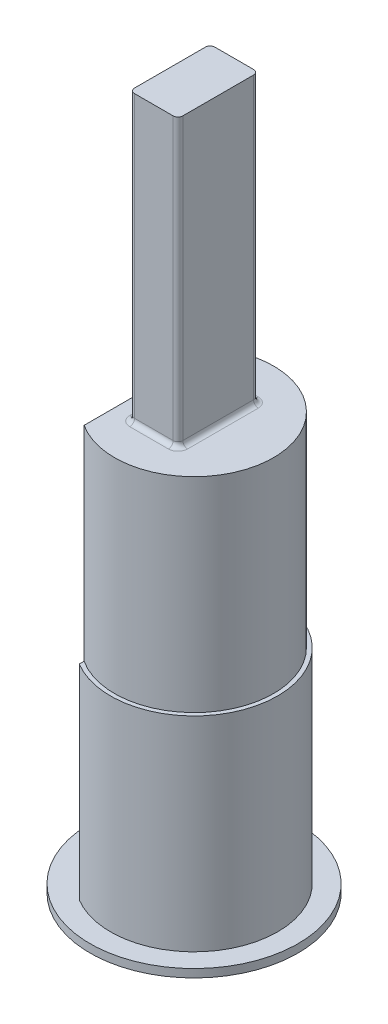
ISO-10303-21;
HEADER;
FILE_DESCRIPTION(('STEP AP214'),'2;1');
FILE_NAME('part.step','',(''),(''),'','','');
FILE_SCHEMA(('AUTOMOTIVE_DESIGN { 1 0 10303 214 1 1 1 1 }'));
ENDSEC;
DATA;
#1=APPLICATION_CONTEXT('core data for automotive mechanical design processes');
#2=APPLICATION_PROTOCOL_DEFINITION('international standard','automotive_design',2000,#1);
#3=PRODUCT_CONTEXT('',#1,'mechanical');
#4=PRODUCT('Part','Part','',(#3));
#5=PRODUCT_RELATED_PRODUCT_CATEGORY('part','',(#4));
#6=PRODUCT_DEFINITION_FORMATION('','',#4);
#7=PRODUCT_DEFINITION_CONTEXT('part definition',#1,'design');
#8=PRODUCT_DEFINITION('design','',#6,#7);
#9=PRODUCT_DEFINITION_SHAPE('','',#8);
#10=(LENGTH_UNIT() NAMED_UNIT(*) SI_UNIT(.MILLI.,.METRE.));
#11=(NAMED_UNIT(*) PLANE_ANGLE_UNIT() SI_UNIT($,.RADIAN.));
#12=(NAMED_UNIT(*) SI_UNIT($,.STERADIAN.) SOLID_ANGLE_UNIT());
#13=UNCERTAINTY_MEASURE_WITH_UNIT(LENGTH_MEASURE(1.E-05),#10,'distance_accuracy_value','');
#14=(GEOMETRIC_REPRESENTATION_CONTEXT(3) GLOBAL_UNCERTAINTY_ASSIGNED_CONTEXT((#13)) GLOBAL_UNIT_ASSIGNED_CONTEXT((#10,
#11,#12)) REPRESENTATION_CONTEXT('',''));
#15=CARTESIAN_POINT('',(0.,0.,0.));
#16=DIRECTION('',(0.,0.,1.));
#17=DIRECTION('',(1.,0.,0.));
#18=AXIS2_PLACEMENT_3D('',#15,#16,#17);
#19=CARTESIAN_POINT('',(0.,25.4,0.));
#20=DIRECTION('',(0.,1.,0.));
#21=DIRECTION('',(0.,0.,1.));
#22=AXIS2_PLACEMENT_3D('',#19,#20,#21);
#23=PLANE('',#22);
#24=DIRECTION('',(0.,0.,-1.));
#25=VECTOR('',#24,1.);
#26=CARTESIAN_POINT('',(1.8,25.4,0.));
#27=LINE('',#26,#25);
#28=CARTESIAN_POINT('',(1.8,25.4,-2.2));
#29=VERTEX_POINT('',#28);
#30=CARTESIAN_POINT('',(1.8,25.4,2.2));
#31=VERTEX_POINT('',#30);
#32=EDGE_CURVE('E223',#29,#31,#27,.F.);
#33=ORIENTED_EDGE('',*,*,#32,.T.);
#34=CARTESIAN_POINT('',(1.2,25.4,2.2));
#35=DIRECTION('',(0.,1.,0.));
#36=DIRECTION('',(0.,0.,1.));
#37=AXIS2_PLACEMENT_3D('',#34,#35,#36);
#38=CIRCLE('',#37,0.6);
#39=CARTESIAN_POINT('',(1.2,25.4,2.8));
#40=VERTEX_POINT('',#39);
#41=EDGE_CURVE('E208',#31,#40,#38,.F.);
#42=ORIENTED_EDGE('',*,*,#41,.T.);
#43=DIRECTION('',(1.,0.,0.));
#44=VECTOR('',#43,1.);
#45=CARTESIAN_POINT('',(0.,25.4,2.8));
#46=LINE('',#45,#44);
#47=CARTESIAN_POINT('',(-1.2,25.4,2.8));
#48=VERTEX_POINT('',#47);
#49=EDGE_CURVE('E211',#40,#48,#46,.F.);
#50=ORIENTED_EDGE('',*,*,#49,.T.);
#51=CARTESIAN_POINT('',(-1.2,25.4,2.2));
#52=DIRECTION('',(0.,1.,0.));
#53=DIRECTION('',(0.,0.,1.));
#54=AXIS2_PLACEMENT_3D('',#51,#52,#53);
#55=CIRCLE('',#54,0.6);
#56=CARTESIAN_POINT('',(-1.8,25.4,2.2));
#57=VERTEX_POINT('',#56);
#58=EDGE_CURVE('E213',#48,#57,#55,.F.);
#59=ORIENTED_EDGE('',*,*,#58,.T.);
#60=DIRECTION('',(0.,0.,1.));
#61=VECTOR('',#60,1.);
#62=CARTESIAN_POINT('',(-1.8,25.4,0.));
#63=LINE('',#62,#61);
#64=CARTESIAN_POINT('',(-1.8,25.4,-2.2));
#65=VERTEX_POINT('',#64);
#66=EDGE_CURVE('E215',#57,#65,#63,.F.);
#67=ORIENTED_EDGE('',*,*,#66,.T.);
#68=CARTESIAN_POINT('',(-1.2,25.4,-2.2));
#69=DIRECTION('',(0.,1.,0.));
#70=DIRECTION('',(0.,0.,1.));
#71=AXIS2_PLACEMENT_3D('',#68,#69,#70);
#72=CIRCLE('',#71,0.6);
#73=CARTESIAN_POINT('',(-1.2,25.4,-2.8));
#74=VERTEX_POINT('',#73);
#75=EDGE_CURVE('E217',#65,#74,#72,.F.);
#76=ORIENTED_EDGE('',*,*,#75,.T.);
#77=DIRECTION('',(-1.,0.,0.));
#78=VECTOR('',#77,1.);
#79=CARTESIAN_POINT('',(0.,25.4,-2.8));
#80=LINE('',#79,#78);
#81=CARTESIAN_POINT('',(1.2,25.4,-2.8));
#82=VERTEX_POINT('',#81);
#83=EDGE_CURVE('E219',#74,#82,#80,.F.);
#84=ORIENTED_EDGE('',*,*,#83,.T.);
#85=CARTESIAN_POINT('',(1.2,25.4,-2.2));
#86=DIRECTION('',(0.,1.,0.));
#87=DIRECTION('',(0.,0.,1.));
#88=AXIS2_PLACEMENT_3D('',#85,#86,#87);
#89=CIRCLE('',#88,0.6);
#90=EDGE_CURVE('E221',#82,#29,#89,.F.);
#91=ORIENTED_EDGE('',*,*,#90,.T.);
#92=EDGE_LOOP('',(#33,#42,#50,#59,#67,#76,#84,#91));
#93=FACE_BOUND('',#92,.T.);
#94=DIRECTION('',(0.,0.,1.));
#95=VECTOR('',#94,1.);
#96=CARTESIAN_POINT('',(-2.68996703044852,25.4,-4.445));
#97=LINE('',#96,#95);
#98=CARTESIAN_POINT('',(-2.68996703044852,25.4,-4.14526132348734));
#99=VERTEX_POINT('',#98);
#100=CARTESIAN_POINT('',(-2.68996703044852,25.4,4.14526132348734));
#101=VERTEX_POINT('',#100);
#102=EDGE_CURVE('E168',#99,#101,#97,.T.);
#103=ORIENTED_EDGE('',*,*,#102,.T.);
#104=CARTESIAN_POINT('',(0.,25.4,0.));
#105=DIRECTION('',(0.,1.,0.));
#106=DIRECTION('',(0.,0.,1.));
#107=AXIS2_PLACEMENT_3D('',#104,#105,#106);
#108=CIRCLE('',#107,4.94157);
#109=EDGE_CURVE('E54',#101,#99,#108,.T.);
#110=ORIENTED_EDGE('',*,*,#109,.T.);
#111=EDGE_LOOP('',(#103,#110));
#112=FACE_BOUND('',#111,.T.);
#113=ADVANCED_FACE('F38',(#93,#112),#23,.T.);
#114=CARTESIAN_POINT('',(0.,25.4,0.));
#115=DIRECTION('',(0.,-1.,0.));
#116=DIRECTION('',(0.,0.,-1.));
#117=AXIS2_PLACEMENT_3D('',#114,#115,#116);
#118=CYLINDRICAL_SURFACE('',#117,5.19557);
#119=CARTESIAN_POINT('',(0.,12.7,0.));
#120=DIRECTION('',(0.,1.,0.));
#121=DIRECTION('',(0.,0.,1.));
#122=AXIS2_PLACEMENT_3D('',#119,#120,#121);
#123=CIRCLE('',#122,5.19557);
#124=CARTESIAN_POINT('',(-2.68996703044852,12.7,4.445));
#125=VERTEX_POINT('',#124);
#126=CARTESIAN_POINT('',(-2.68996703044852,12.7,-4.445));
#127=VERTEX_POINT('',#126);
#128=EDGE_CURVE('E158',#125,#127,#123,.T.);
#129=ORIENTED_EDGE('',*,*,#128,.F.);
#130=DIRECTION('',(0.,-1.,0.));
#131=VECTOR('',#130,1.);
#132=CARTESIAN_POINT('',(-2.68996703044852,25.4,4.445));
#133=LINE('',#132,#131);
#134=CARTESIAN_POINT('',(-2.68996703044852,0.,4.445));
#135=VERTEX_POINT('',#134);
#136=EDGE_CURVE('E230',#125,#135,#133,.T.);
#137=ORIENTED_EDGE('',*,*,#136,.T.);
#138=CARTESIAN_POINT('',(0.,0.,0.));
#139=DIRECTION('',(0.,1.,0.));
#140=DIRECTION('',(0.,0.,1.));
#141=AXIS2_PLACEMENT_3D('',#138,#139,#140);
#142=CIRCLE('',#141,5.19557);
#143=CARTESIAN_POINT('',(-2.68996703044852,0.,-4.445));
#144=VERTEX_POINT('',#143);
#145=EDGE_CURVE('E235',#135,#144,#142,.T.);
#146=ORIENTED_EDGE('',*,*,#145,.T.);
#147=DIRECTION('',(0.,-1.,0.));
#148=VECTOR('',#147,1.);
#149=CARTESIAN_POINT('',(-2.68996703044852,25.4,-4.445));
#150=LINE('',#149,#148);
#151=EDGE_CURVE('E228',#127,#144,#150,.T.);
#152=ORIENTED_EDGE('',*,*,#151,.F.);
#153=EDGE_LOOP('',(#129,#137,#146,#152));
#154=FACE_BOUND('',#153,.T.);
#155=ADVANCED_FACE('F285',(#154),#118,.T.);
#156=CARTESIAN_POINT('',(-2.68996703044852,25.4,-4.445));
#157=DIRECTION('',(1.,0.,0.));
#158=DIRECTION('',(0.,0.,-1.));
#159=AXIS2_PLACEMENT_3D('',#156,#157,#158);
#160=PLANE('',#159);
#161=DIRECTION('',(0.,0.,1.));
#162=VECTOR('',#161,1.);
#163=CARTESIAN_POINT('',(-2.68996703044852,12.7,-4.445));
#164=LINE('',#163,#162);
#165=CARTESIAN_POINT('',(-2.68996703044852,12.7,-4.14526132348734));
#166=VERTEX_POINT('',#165);
#167=EDGE_CURVE('E12',#127,#166,#164,.T.);
#168=ORIENTED_EDGE('',*,*,#167,.F.);
#169=ORIENTED_EDGE('',*,*,#151,.T.);
#170=DIRECTION('',(0.,0.,1.));
#171=VECTOR('',#170,1.);
#172=CARTESIAN_POINT('',(-2.68996703044852,0.,-4.445));
#173=LINE('',#172,#171);
#174=EDGE_CURVE('E232',#144,#135,#173,.T.);
#175=ORIENTED_EDGE('',*,*,#174,.T.);
#176=ORIENTED_EDGE('',*,*,#136,.F.);
#177=CARTESIAN_POINT('',(-2.68996703044852,12.7,4.14526132348734));
#178=VERTEX_POINT('',#177);
#179=EDGE_CURVE('E47',#178,#125,#164,.T.);
#180=ORIENTED_EDGE('',*,*,#179,.F.);
#181=DIRECTION('',(0.,1.,0.));
#182=VECTOR('',#181,1.);
#183=CARTESIAN_POINT('',(-2.68996703044852,12.7,4.14526132348734));
#184=LINE('',#183,#182);
#185=EDGE_CURVE('E163',#101,#178,#184,.F.);
#186=ORIENTED_EDGE('',*,*,#185,.F.);
#187=ORIENTED_EDGE('',*,*,#102,.F.);
#188=DIRECTION('',(0.,1.,0.));
#189=VECTOR('',#188,1.);
#190=CARTESIAN_POINT('',(-2.68996703044852,12.7,-4.14526132348734));
#191=LINE('',#190,#189);
#192=EDGE_CURVE('E42',#166,#99,#191,.T.);
#193=ORIENTED_EDGE('',*,*,#192,.F.);
#194=EDGE_LOOP('',(#168,#169,#175,#176,#180,#186,#187,#193));
#195=FACE_BOUND('',#194,.T.);
#196=ADVANCED_FACE('F166',(#195),#160,.F.);
#197=CARTESIAN_POINT('',(-1.2,43.18,2.2));
#198=DIRECTION('',(0.,-1.,0.));
#199=DIRECTION('',(0.,0.,-1.));
#200=AXIS2_PLACEMENT_3D('',#197,#198,#199);
#201=CYLINDRICAL_SURFACE('',#200,0.3);
#202=DIRECTION('',(0.,-1.,0.));
#203=VECTOR('',#202,1.);
#204=CARTESIAN_POINT('',(-1.5,43.18,2.2));
#205=LINE('',#204,#203);
#206=CARTESIAN_POINT('',(-1.5,43.18,2.2));
#207=VERTEX_POINT('',#206);
#208=CARTESIAN_POINT('',(-1.5,25.7,2.2));
#209=VERTEX_POINT('',#208);
#210=EDGE_CURVE('E258',#207,#209,#205,.T.);
#211=ORIENTED_EDGE('',*,*,#210,.T.);
#212=CARTESIAN_POINT('',(-1.2,25.7,2.2));
#213=DIRECTION('',(0.,1.,0.));
#214=DIRECTION('',(0.,0.,1.));
#215=AXIS2_PLACEMENT_3D('',#212,#213,#214);
#216=CIRCLE('',#215,0.3);
#217=CARTESIAN_POINT('',(-1.2,25.7,2.5));
#218=VERTEX_POINT('',#217);
#219=EDGE_CURVE('E204',#209,#218,#216,.T.);
#220=ORIENTED_EDGE('',*,*,#219,.T.);
#221=DIRECTION('',(0.,-1.,0.));
#222=VECTOR('',#221,1.);
#223=CARTESIAN_POINT('',(-1.2,43.18,2.5));
#224=LINE('',#223,#222);
#225=CARTESIAN_POINT('',(-1.2,43.18,2.5));
#226=VERTEX_POINT('',#225);
#227=EDGE_CURVE('E238',#226,#218,#224,.T.);
#228=ORIENTED_EDGE('',*,*,#227,.F.);
#229=CARTESIAN_POINT('',(-1.2,43.18,2.2));
#230=DIRECTION('',(0.,1.,0.));
#231=DIRECTION('',(0.,0.,-1.));
#232=AXIS2_PLACEMENT_3D('',#229,#230,#231);
#233=CIRCLE('',#232,0.3);
#234=EDGE_CURVE('E174',#207,#226,#233,.T.);
#235=ORIENTED_EDGE('',*,*,#234,.F.);
#236=EDGE_LOOP('',(#211,#220,#228,#235));
#237=FACE_BOUND('',#236,.T.);
#238=ADVANCED_FACE('F295',(#237),#201,.T.);
#239=CARTESIAN_POINT('',(-1.2,43.18,2.5));
#240=DIRECTION('',(0.,0.,-1.));
#241=DIRECTION('',(-1.,0.,0.));
#242=AXIS2_PLACEMENT_3D('',#239,#240,#241);
#243=PLANE('',#242);
#244=ORIENTED_EDGE('',*,*,#227,.T.);
#245=DIRECTION('',(1.,0.,0.));
#246=VECTOR('',#245,1.);
#247=CARTESIAN_POINT('',(-1.2,25.7,2.5));
#248=LINE('',#247,#246);
#249=CARTESIAN_POINT('',(1.2,25.7,2.5));
#250=VERTEX_POINT('',#249);
#251=EDGE_CURVE('E206',#218,#250,#248,.T.);
#252=ORIENTED_EDGE('',*,*,#251,.T.);
#253=DIRECTION('',(0.,-1.,0.));
#254=VECTOR('',#253,1.);
#255=CARTESIAN_POINT('',(1.2,43.18,2.5));
#256=LINE('',#255,#254);
#257=CARTESIAN_POINT('',(1.2,43.18,2.5));
#258=VERTEX_POINT('',#257);
#259=EDGE_CURVE('E242',#258,#250,#256,.T.);
#260=ORIENTED_EDGE('',*,*,#259,.F.);
#261=DIRECTION('',(1.,0.,0.));
#262=VECTOR('',#261,1.);
#263=CARTESIAN_POINT('',(-1.2,43.18,2.5));
#264=LINE('',#263,#262);
#265=EDGE_CURVE('E273',#226,#258,#264,.T.);
#266=ORIENTED_EDGE('',*,*,#265,.F.);
#267=EDGE_LOOP('',(#244,#252,#260,#266));
#268=FACE_BOUND('',#267,.T.);
#269=ADVANCED_FACE('F349',(#268),#243,.F.);
#270=CARTESIAN_POINT('',(1.2,43.18,2.2));
#271=DIRECTION('',(0.,-1.,0.));
#272=DIRECTION('',(0.,0.,-1.));
#273=AXIS2_PLACEMENT_3D('',#270,#271,#272);
#274=CYLINDRICAL_SURFACE('',#273,0.3);
#275=ORIENTED_EDGE('',*,*,#259,.T.);
#276=CARTESIAN_POINT('',(1.2,25.7,2.2));
#277=DIRECTION('',(0.,1.,0.));
#278=DIRECTION('',(0.,0.,1.));
#279=AXIS2_PLACEMENT_3D('',#276,#277,#278);
#280=CIRCLE('',#279,0.3);
#281=CARTESIAN_POINT('',(1.5,25.7,2.2));
#282=VERTEX_POINT('',#281);
#283=EDGE_CURVE('E225',#250,#282,#280,.T.);
#284=ORIENTED_EDGE('',*,*,#283,.T.);
#285=DIRECTION('',(0.,-1.,0.));
#286=VECTOR('',#285,1.);
#287=CARTESIAN_POINT('',(1.5,43.18,2.2));
#288=LINE('',#287,#286);
#289=CARTESIAN_POINT('',(1.5,43.18,2.2));
#290=VERTEX_POINT('',#289);
#291=EDGE_CURVE('E245',#290,#282,#288,.T.);
#292=ORIENTED_EDGE('',*,*,#291,.F.);
#293=CARTESIAN_POINT('',(1.2,43.18,2.2));
#294=DIRECTION('',(0.,1.,0.));
#295=DIRECTION('',(0.,0.,1.));
#296=AXIS2_PLACEMENT_3D('',#293,#294,#295);
#297=CIRCLE('',#296,0.3);
#298=EDGE_CURVE('E271',#258,#290,#297,.T.);
#299=ORIENTED_EDGE('',*,*,#298,.F.);
#300=EDGE_LOOP('',(#275,#284,#292,#299));
#301=FACE_BOUND('',#300,.T.);
#302=ADVANCED_FACE('F353',(#301),#274,.T.);
#303=CARTESIAN_POINT('',(1.5,43.18,2.2));
#304=DIRECTION('',(-1.,0.,0.));
#305=DIRECTION('',(0.,0.,1.));
#306=AXIS2_PLACEMENT_3D('',#303,#304,#305);
#307=PLANE('',#306);
#308=ORIENTED_EDGE('',*,*,#291,.T.);
#309=DIRECTION('',(0.,0.,-1.));
#310=VECTOR('',#309,1.);
#311=CARTESIAN_POINT('',(1.5,25.7,2.2));
#312=LINE('',#311,#310);
#313=CARTESIAN_POINT('',(1.5,25.7,-2.2));
#314=VERTEX_POINT('',#313);
#315=EDGE_CURVE('E62',#282,#314,#312,.T.);
#316=ORIENTED_EDGE('',*,*,#315,.T.);
#317=DIRECTION('',(0.,-1.,0.));
#318=VECTOR('',#317,1.);
#319=CARTESIAN_POINT('',(1.5,43.18,-2.2));
#320=LINE('',#319,#318);
#321=CARTESIAN_POINT('',(1.5,43.18,-2.2));
#322=VERTEX_POINT('',#321);
#323=EDGE_CURVE('E247',#322,#314,#320,.T.);
#324=ORIENTED_EDGE('',*,*,#323,.F.);
#325=DIRECTION('',(0.,0.,-1.));
#326=VECTOR('',#325,1.);
#327=CARTESIAN_POINT('',(1.5,43.18,2.2));
#328=LINE('',#327,#326);
#329=EDGE_CURVE('E269',#290,#322,#328,.T.);
#330=ORIENTED_EDGE('',*,*,#329,.F.);
#331=EDGE_LOOP('',(#308,#316,#324,#330));
#332=FACE_BOUND('',#331,.T.);
#333=ADVANCED_FACE('F382',(#332),#307,.F.);
#334=CARTESIAN_POINT('',(1.2,43.18,-2.2));
#335=DIRECTION('',(0.,-1.,0.));
#336=DIRECTION('',(0.,0.,-1.));
#337=AXIS2_PLACEMENT_3D('',#334,#335,#336);
#338=CYLINDRICAL_SURFACE('',#337,0.3);
#339=ORIENTED_EDGE('',*,*,#323,.T.);
#340=CARTESIAN_POINT('',(1.2,25.7,-2.2));
#341=DIRECTION('',(0.,1.,0.));
#342=DIRECTION('',(0.,0.,1.));
#343=AXIS2_PLACEMENT_3D('',#340,#341,#342);
#344=CIRCLE('',#343,0.3);
#345=CARTESIAN_POINT('',(1.2,25.7,-2.5));
#346=VERTEX_POINT('',#345);
#347=EDGE_CURVE('E196',#314,#346,#344,.T.);
#348=ORIENTED_EDGE('',*,*,#347,.T.);
#349=DIRECTION('',(0.,-1.,0.));
#350=VECTOR('',#349,1.);
#351=CARTESIAN_POINT('',(1.2,43.18,-2.5));
#352=LINE('',#351,#350);
#353=CARTESIAN_POINT('',(1.2,43.18,-2.5));
#354=VERTEX_POINT('',#353);
#355=EDGE_CURVE('E249',#354,#346,#352,.T.);
#356=ORIENTED_EDGE('',*,*,#355,.F.);
#357=CARTESIAN_POINT('',(1.2,43.18,-2.2));
#358=DIRECTION('',(0.,1.,0.));
#359=DIRECTION('',(0.,0.,-1.));
#360=AXIS2_PLACEMENT_3D('',#357,#358,#359);
#361=CIRCLE('',#360,0.3);
#362=EDGE_CURVE('E267',#322,#354,#361,.T.);
#363=ORIENTED_EDGE('',*,*,#362,.F.);
#364=EDGE_LOOP('',(#339,#348,#356,#363));
#365=FACE_BOUND('',#364,.T.);
#366=ADVANCED_FACE('F380',(#365),#338,.T.);
#367=CARTESIAN_POINT('',(-1.2,43.18,-2.5));
#368=DIRECTION('',(0.,0.,1.));
#369=DIRECTION('',(1.,0.,0.));
#370=AXIS2_PLACEMENT_3D('',#367,#368,#369);
#371=PLANE('',#370);
#372=ORIENTED_EDGE('',*,*,#355,.T.);
#373=DIRECTION('',(-1.,0.,0.));
#374=VECTOR('',#373,1.);
#375=CARTESIAN_POINT('',(-1.2,25.7,-2.5));
#376=LINE('',#375,#374);
#377=CARTESIAN_POINT('',(-1.2,25.7,-2.5));
#378=VERTEX_POINT('',#377);
#379=EDGE_CURVE('E198',#346,#378,#376,.T.);
#380=ORIENTED_EDGE('',*,*,#379,.T.);
#381=DIRECTION('',(0.,-1.,0.));
#382=VECTOR('',#381,1.);
#383=CARTESIAN_POINT('',(-1.2,43.18,-2.5));
#384=LINE('',#383,#382);
#385=CARTESIAN_POINT('',(-1.2,43.18,-2.5));
#386=VERTEX_POINT('',#385);
#387=EDGE_CURVE('E252',#386,#378,#384,.T.);
#388=ORIENTED_EDGE('',*,*,#387,.F.);
#389=DIRECTION('',(-1.,0.,0.));
#390=VECTOR('',#389,1.);
#391=CARTESIAN_POINT('',(-1.2,43.18,-2.5));
#392=LINE('',#391,#390);
#393=EDGE_CURVE('E265',#354,#386,#392,.T.);
#394=ORIENTED_EDGE('',*,*,#393,.F.);
#395=EDGE_LOOP('',(#372,#380,#388,#394));
#396=FACE_BOUND('',#395,.T.);
#397=ADVANCED_FACE('F370',(#396),#371,.F.);
#398=CARTESIAN_POINT('',(-1.2,43.18,-2.2));
#399=DIRECTION('',(0.,-1.,0.));
#400=DIRECTION('',(0.,0.,-1.));
#401=AXIS2_PLACEMENT_3D('',#398,#399,#400);
#402=CYLINDRICAL_SURFACE('',#401,0.3);
#403=ORIENTED_EDGE('',*,*,#387,.T.);
#404=CARTESIAN_POINT('',(-1.2,25.7,-2.2));
#405=DIRECTION('',(0.,1.,0.));
#406=DIRECTION('',(0.,0.,1.));
#407=AXIS2_PLACEMENT_3D('',#404,#405,#406);
#408=CIRCLE('',#407,0.3);
#409=CARTESIAN_POINT('',(-1.5,25.7,-2.2));
#410=VERTEX_POINT('',#409);
#411=EDGE_CURVE('E200',#378,#410,#408,.T.);
#412=ORIENTED_EDGE('',*,*,#411,.T.);
#413=DIRECTION('',(0.,-1.,0.));
#414=VECTOR('',#413,1.);
#415=CARTESIAN_POINT('',(-1.5,43.18,-2.2));
#416=LINE('',#415,#414);
#417=CARTESIAN_POINT('',(-1.5,43.18,-2.2));
#418=VERTEX_POINT('',#417);
#419=EDGE_CURVE('E255',#418,#410,#416,.T.);
#420=ORIENTED_EDGE('',*,*,#419,.F.);
#421=CARTESIAN_POINT('',(-1.2,43.18,-2.2));
#422=DIRECTION('',(0.,1.,0.));
#423=DIRECTION('',(0.,0.,-1.));
#424=AXIS2_PLACEMENT_3D('',#421,#422,#423);
#425=CIRCLE('',#424,0.3);
#426=EDGE_CURVE('E263',#386,#418,#425,.T.);
#427=ORIENTED_EDGE('',*,*,#426,.F.);
#428=EDGE_LOOP('',(#403,#412,#420,#427));
#429=FACE_BOUND('',#428,.T.);
#430=ADVANCED_FACE('F366',(#429),#402,.T.);
#431=CARTESIAN_POINT('',(-1.5,43.18,2.2));
#432=DIRECTION('',(1.,0.,0.));
#433=DIRECTION('',(0.,0.,-1.));
#434=AXIS2_PLACEMENT_3D('',#431,#432,#433);
#435=PLANE('',#434);
#436=ORIENTED_EDGE('',*,*,#419,.T.);
#437=DIRECTION('',(0.,0.,1.));
#438=VECTOR('',#437,1.);
#439=CARTESIAN_POINT('',(-1.5,25.7,2.2));
#440=LINE('',#439,#438);
#441=EDGE_CURVE('E202',#410,#209,#440,.T.);
#442=ORIENTED_EDGE('',*,*,#441,.T.);
#443=ORIENTED_EDGE('',*,*,#210,.F.);
#444=DIRECTION('',(0.,0.,1.));
#445=VECTOR('',#444,1.);
#446=CARTESIAN_POINT('',(-1.5,43.18,2.2));
#447=LINE('',#446,#445);
#448=EDGE_CURVE('E261',#418,#207,#447,.T.);
#449=ORIENTED_EDGE('',*,*,#448,.F.);
#450=EDGE_LOOP('',(#436,#442,#443,#449));
#451=FACE_BOUND('',#450,.T.);
#452=ADVANCED_FACE('F362',(#451),#435,.F.);
#453=CARTESIAN_POINT('',(-1.2,43.18,2.2));
#454=DIRECTION('',(0.,-1.,0.));
#455=DIRECTION('',(0.,0.,-1.));
#456=AXIS2_PLACEMENT_3D('',#453,#454,#455);
#457=PLANE('',#456);
#458=ORIENTED_EDGE('',*,*,#234,.T.);
#459=ORIENTED_EDGE('',*,*,#265,.T.);
#460=ORIENTED_EDGE('',*,*,#298,.T.);
#461=ORIENTED_EDGE('',*,*,#329,.T.);
#462=ORIENTED_EDGE('',*,*,#362,.T.);
#463=ORIENTED_EDGE('',*,*,#393,.T.);
#464=ORIENTED_EDGE('',*,*,#426,.T.);
#465=ORIENTED_EDGE('',*,*,#448,.T.);
#466=EDGE_LOOP('',(#458,#459,#460,#461,#462,#463,#464,#465));
#467=FACE_BOUND('',#466,.T.);
#468=ADVANCED_FACE('F329',(#467),#457,.F.);
#469=CARTESIAN_POINT('',(-1.2,25.7,-2.2));
#470=DIRECTION('',(0.,1.,0.));
#471=DIRECTION('',(0.,0.,1.));
#472=AXIS2_PLACEMENT_3D('',#469,#470,#471);
#473=TOROIDAL_SURFACE('',#472,0.6,0.3);
#474=CARTESIAN_POINT('',(-1.2,25.7,-2.8));
#475=DIRECTION('',(-1.,0.,0.));
#476=DIRECTION('',(0.,0.,1.));
#477=AXIS2_PLACEMENT_3D('',#474,#475,#476);
#478=CIRCLE('',#477,0.3);
#479=EDGE_CURVE('E175',#74,#378,#478,.T.);
#480=ORIENTED_EDGE('',*,*,#479,.F.);
#481=ORIENTED_EDGE('',*,*,#75,.F.);
#482=CARTESIAN_POINT('',(-1.8,25.7,-2.2));
#483=DIRECTION('',(0.,0.,-1.));
#484=DIRECTION('',(-1.,0.,0.));
#485=AXIS2_PLACEMENT_3D('',#482,#483,#484);
#486=CIRCLE('',#485,0.3);
#487=EDGE_CURVE('E171',#410,#65,#486,.T.);
#488=ORIENTED_EDGE('',*,*,#487,.F.);
#489=ORIENTED_EDGE('',*,*,#411,.F.);
#490=EDGE_LOOP('',(#480,#481,#488,#489));
#491=FACE_BOUND('',#490,.T.);
#492=ADVANCED_FACE('F40',(#491),#473,.F.);
#493=CARTESIAN_POINT('',(-1.8,25.7,2.2));
#494=DIRECTION('',(0.,0.,1.));
#495=DIRECTION('',(1.,0.,0.));
#496=AXIS2_PLACEMENT_3D('',#493,#494,#495);
#497=CYLINDRICAL_SURFACE('',#496,0.3);
#498=ORIENTED_EDGE('',*,*,#487,.T.);
#499=ORIENTED_EDGE('',*,*,#66,.F.);
#500=CARTESIAN_POINT('',(-1.8,25.7,2.2));
#501=DIRECTION('',(0.,0.,-1.));
#502=DIRECTION('',(0.,1.,0.));
#503=AXIS2_PLACEMENT_3D('',#500,#501,#502);
#504=CIRCLE('',#503,0.3);
#505=EDGE_CURVE('E178',#209,#57,#504,.T.);
#506=ORIENTED_EDGE('',*,*,#505,.F.);
#507=ORIENTED_EDGE('',*,*,#441,.F.);
#508=EDGE_LOOP('',(#498,#499,#506,#507));
#509=FACE_BOUND('',#508,.T.);
#510=ADVANCED_FACE('F322',(#509),#497,.F.);
#511=CARTESIAN_POINT('',(-1.2,25.7,-2.8));
#512=DIRECTION('',(-1.,0.,0.));
#513=DIRECTION('',(0.,0.,1.));
#514=AXIS2_PLACEMENT_3D('',#511,#512,#513);
#515=CYLINDRICAL_SURFACE('',#514,0.3);
#516=ORIENTED_EDGE('',*,*,#479,.T.);
#517=ORIENTED_EDGE('',*,*,#379,.F.);
#518=CARTESIAN_POINT('',(1.2,25.7,-2.8));
#519=DIRECTION('',(-1.,0.,0.));
#520=DIRECTION('',(0.,0.,1.));
#521=AXIS2_PLACEMENT_3D('',#518,#519,#520);
#522=CIRCLE('',#521,0.3);
#523=EDGE_CURVE('E181',#82,#346,#522,.T.);
#524=ORIENTED_EDGE('',*,*,#523,.F.);
#525=ORIENTED_EDGE('',*,*,#83,.F.);
#526=EDGE_LOOP('',(#516,#517,#524,#525));
#527=FACE_BOUND('',#526,.T.);
#528=ADVANCED_FACE('F319',(#527),#515,.F.);
#529=CARTESIAN_POINT('',(-1.2,25.7,2.2));
#530=DIRECTION('',(0.,1.,0.));
#531=DIRECTION('',(0.,0.,1.));
#532=AXIS2_PLACEMENT_3D('',#529,#530,#531);
#533=TOROIDAL_SURFACE('',#532,0.6,0.3);
#534=ORIENTED_EDGE('',*,*,#505,.T.);
#535=ORIENTED_EDGE('',*,*,#58,.F.);
#536=CARTESIAN_POINT('',(-1.2,25.7,2.8));
#537=DIRECTION('',(-1.,0.,0.));
#538=DIRECTION('',(0.,0.,1.));
#539=AXIS2_PLACEMENT_3D('',#536,#537,#538);
#540=CIRCLE('',#539,0.3);
#541=EDGE_CURVE('E184',#218,#48,#540,.T.);
#542=ORIENTED_EDGE('',*,*,#541,.F.);
#543=ORIENTED_EDGE('',*,*,#219,.F.);
#544=EDGE_LOOP('',(#534,#535,#542,#543));
#545=FACE_BOUND('',#544,.T.);
#546=ADVANCED_FACE('F315',(#545),#533,.F.);
#547=CARTESIAN_POINT('',(1.2,25.7,-2.2));
#548=DIRECTION('',(0.,1.,0.));
#549=DIRECTION('',(0.,0.,1.));
#550=AXIS2_PLACEMENT_3D('',#547,#548,#549);
#551=TOROIDAL_SURFACE('',#550,0.6,0.3);
#552=ORIENTED_EDGE('',*,*,#523,.T.);
#553=ORIENTED_EDGE('',*,*,#347,.F.);
#554=CARTESIAN_POINT('',(1.8,25.7,-2.2));
#555=DIRECTION('',(0.,0.,-1.));
#556=DIRECTION('',(-1.,0.,0.));
#557=AXIS2_PLACEMENT_3D('',#554,#555,#556);
#558=CIRCLE('',#557,0.3);
#559=EDGE_CURVE('E187',#29,#314,#558,.T.);
#560=ORIENTED_EDGE('',*,*,#559,.F.);
#561=ORIENTED_EDGE('',*,*,#90,.F.);
#562=EDGE_LOOP('',(#552,#553,#560,#561));
#563=FACE_BOUND('',#562,.T.);
#564=ADVANCED_FACE('F311',(#563),#551,.F.);
#565=CARTESIAN_POINT('',(-1.2,25.7,2.8));
#566=DIRECTION('',(1.,0.,0.));
#567=DIRECTION('',(0.,0.,-1.));
#568=AXIS2_PLACEMENT_3D('',#565,#566,#567);
#569=CYLINDRICAL_SURFACE('',#568,0.3);
#570=ORIENTED_EDGE('',*,*,#541,.T.);
#571=ORIENTED_EDGE('',*,*,#49,.F.);
#572=CARTESIAN_POINT('',(1.2,25.7,2.8));
#573=DIRECTION('',(-1.,0.,0.));
#574=DIRECTION('',(0.,-1.,0.));
#575=AXIS2_PLACEMENT_3D('',#572,#573,#574);
#576=CIRCLE('',#575,0.3);
#577=EDGE_CURVE('E190',#250,#40,#576,.T.);
#578=ORIENTED_EDGE('',*,*,#577,.F.);
#579=ORIENTED_EDGE('',*,*,#251,.F.);
#580=EDGE_LOOP('',(#570,#571,#578,#579));
#581=FACE_BOUND('',#580,.T.);
#582=ADVANCED_FACE('F307',(#581),#569,.F.);
#583=CARTESIAN_POINT('',(1.8,25.7,2.2));
#584=DIRECTION('',(0.,0.,-1.));
#585=DIRECTION('',(-1.,0.,0.));
#586=AXIS2_PLACEMENT_3D('',#583,#584,#585);
#587=CYLINDRICAL_SURFACE('',#586,0.3);
#588=ORIENTED_EDGE('',*,*,#559,.T.);
#589=ORIENTED_EDGE('',*,*,#315,.F.);
#590=CARTESIAN_POINT('',(1.8,25.7,2.2));
#591=DIRECTION('',(0.,0.,-1.));
#592=DIRECTION('',(-1.,0.,0.));
#593=AXIS2_PLACEMENT_3D('',#590,#591,#592);
#594=CIRCLE('',#593,0.3);
#595=EDGE_CURVE('E192',#31,#282,#594,.T.);
#596=ORIENTED_EDGE('',*,*,#595,.F.);
#597=ORIENTED_EDGE('',*,*,#32,.F.);
#598=EDGE_LOOP('',(#588,#589,#596,#597));
#599=FACE_BOUND('',#598,.T.);
#600=ADVANCED_FACE('F303',(#599),#587,.F.);
#601=CARTESIAN_POINT('',(1.2,25.7,2.2));
#602=DIRECTION('',(0.,1.,0.));
#603=DIRECTION('',(0.,0.,1.));
#604=AXIS2_PLACEMENT_3D('',#601,#602,#603);
#605=TOROIDAL_SURFACE('',#604,0.6,0.3);
#606=ORIENTED_EDGE('',*,*,#577,.T.);
#607=ORIENTED_EDGE('',*,*,#41,.F.);
#608=ORIENTED_EDGE('',*,*,#595,.T.);
#609=ORIENTED_EDGE('',*,*,#283,.F.);
#610=EDGE_LOOP('',(#606,#607,#608,#609));
#611=FACE_BOUND('',#610,.T.);
#612=ADVANCED_FACE('F299',(#611),#605,.F.);
#613=CARTESIAN_POINT('',(0.,-0.508,0.));
#614=DIRECTION('',(0.,1.,0.));
#615=DIRECTION('',(0.,0.,1.));
#616=AXIS2_PLACEMENT_3D('',#613,#614,#615);
#617=CYLINDRICAL_SURFACE('',#616,6.46557);
#618=CARTESIAN_POINT('',(0.,-0.508,0.));
#619=DIRECTION('',(0.,-1.,0.));
#620=DIRECTION('',(0.,0.,-1.));
#621=AXIS2_PLACEMENT_3D('',#618,#619,#620);
#622=CIRCLE('',#621,6.46557);
#623=CARTESIAN_POINT('',(0.,-0.508,-6.46557));
#624=VERTEX_POINT('',#623);
#625=EDGE_CURVE('E194',#624,#624,#622,.T.);
#626=ORIENTED_EDGE('',*,*,#625,.F.);
#627=EDGE_LOOP('',(#626));
#628=FACE_BOUND('',#627,.T.);
#629=CARTESIAN_POINT('',(0.,0.,0.));
#630=DIRECTION('',(0.,-1.,0.));
#631=DIRECTION('',(0.,0.,-1.));
#632=AXIS2_PLACEMENT_3D('',#629,#630,#631);
#633=CIRCLE('',#632,6.46557);
#634=CARTESIAN_POINT('',(0.,0.,-6.46557));
#635=VERTEX_POINT('',#634);
#636=EDGE_CURVE('E277',#635,#635,#633,.T.);
#637=ORIENTED_EDGE('',*,*,#636,.T.);
#638=EDGE_LOOP('',(#637));
#639=FACE_BOUND('',#638,.T.);
#640=ADVANCED_FACE('F302',(#628,#639),#617,.T.);
#641=CARTESIAN_POINT('',(0.,-0.508,0.));
#642=DIRECTION('',(0.,-1.,0.));
#643=DIRECTION('',(0.,0.,-1.));
#644=AXIS2_PLACEMENT_3D('',#641,#642,#643);
#645=PLANE('',#644);
#646=ORIENTED_EDGE('',*,*,#625,.T.);
#647=EDGE_LOOP('',(#646));
#648=FACE_BOUND('',#647,.T.);
#649=ADVANCED_FACE('F425',(#648),#645,.T.);
#650=CARTESIAN_POINT('',(0.,0.,0.));
#651=DIRECTION('',(0.,-1.,0.));
#652=DIRECTION('',(0.,0.,-1.));
#653=AXIS2_PLACEMENT_3D('',#650,#651,#652);
#654=PLANE('',#653);
#655=ORIENTED_EDGE('',*,*,#145,.F.);
#656=ORIENTED_EDGE('',*,*,#174,.F.);
#657=EDGE_LOOP('',(#655,#656));
#658=FACE_BOUND('',#657,.T.);
#659=ORIENTED_EDGE('',*,*,#636,.F.);
#660=EDGE_LOOP('',(#659));
#661=FACE_BOUND('',#660,.T.);
#662=ADVANCED_FACE('F420',(#658,#661),#654,.F.);
#663=CARTESIAN_POINT('',(0.,12.7,0.));
#664=DIRECTION('',(0.,1.,0.));
#665=DIRECTION('',(0.,0.,1.));
#666=AXIS2_PLACEMENT_3D('',#663,#664,#665);
#667=PLANE('',#666);
#668=ORIENTED_EDGE('',*,*,#167,.T.);
#669=CARTESIAN_POINT('',(0.,12.7,0.));
#670=DIRECTION('',(0.,1.,0.));
#671=DIRECTION('',(0.,0.,1.));
#672=AXIS2_PLACEMENT_3D('',#669,#670,#671);
#673=CIRCLE('',#672,4.94157);
#674=EDGE_CURVE('E155',#178,#166,#673,.T.);
#675=ORIENTED_EDGE('',*,*,#674,.F.);
#676=ORIENTED_EDGE('',*,*,#179,.T.);
#677=ORIENTED_EDGE('',*,*,#128,.T.);
#678=EDGE_LOOP('',(#668,#675,#676,#677));
#679=FACE_BOUND('',#678,.T.);
#680=ADVANCED_FACE('F154',(#679),#667,.T.);
#681=CARTESIAN_POINT('',(0.,12.7,0.));
#682=DIRECTION('',(0.,1.,0.));
#683=DIRECTION('',(0.,0.,1.));
#684=AXIS2_PLACEMENT_3D('',#681,#682,#683);
#685=CYLINDRICAL_SURFACE('',#684,4.94157);
#686=ORIENTED_EDGE('',*,*,#192,.T.);
#687=ORIENTED_EDGE('',*,*,#109,.F.);
#688=ORIENTED_EDGE('',*,*,#185,.T.);
#689=ORIENTED_EDGE('',*,*,#674,.T.);
#690=EDGE_LOOP('',(#686,#687,#688,#689));
#691=FACE_BOUND('',#690,.T.);
#692=ADVANCED_FACE('F162',(#691),#685,.T.);
#693=CLOSED_SHELL('',(#113,#155,#196,#238,#269,#302,#333,#366,#397,#430,#452,#468,#492,#510,
#528,#546,#564,#582,#600,#612,#640,#649,#662,#680,#692));
#694=MANIFOLD_SOLID_BREP('B2',#693);
#695=ADVANCED_BREP_SHAPE_REPRESENTATION('',(#18,#694),#14);
#696=SHAPE_DEFINITION_REPRESENTATION(#9,#695);
ENDSEC;
END-ISO-10303-21;
